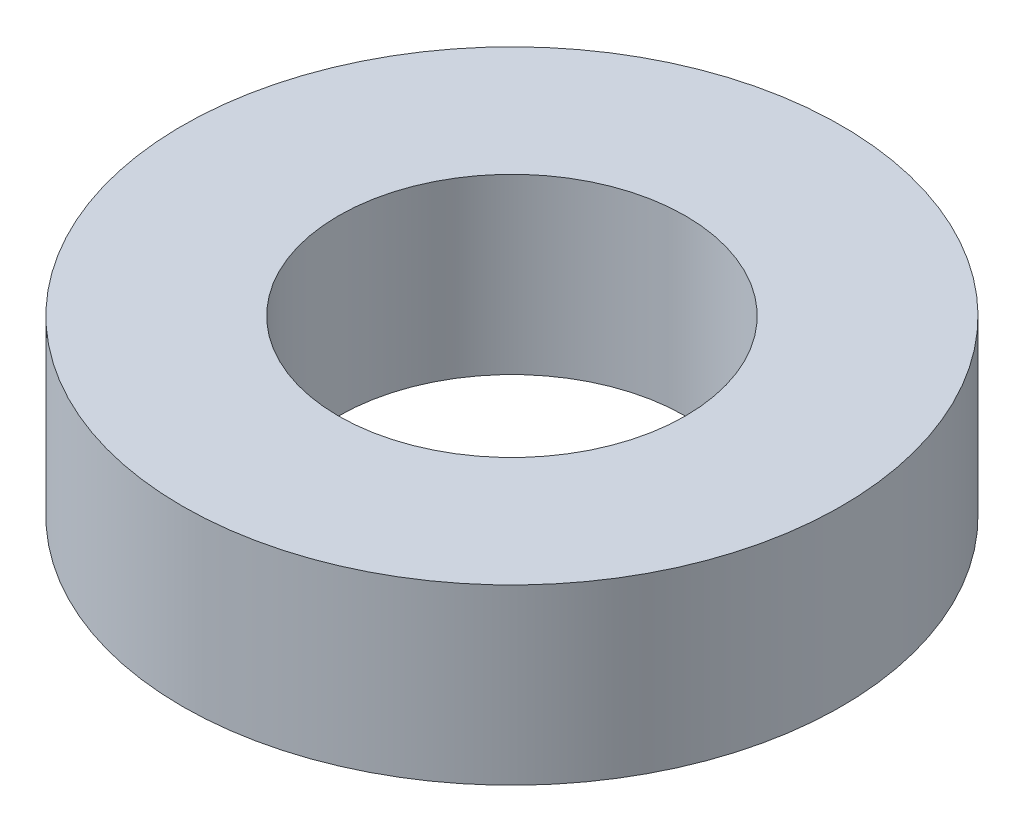
ISO-10303-21;
HEADER;
FILE_DESCRIPTION(('STEP AP214'),'2;1');
FILE_NAME('part.step','',(''),(''),'','','');
FILE_SCHEMA(('AUTOMOTIVE_DESIGN { 1 0 10303 214 1 1 1 1 }'));
ENDSEC;
DATA;
#1=APPLICATION_CONTEXT('core data for automotive mechanical design processes');
#2=APPLICATION_PROTOCOL_DEFINITION('international standard','automotive_design',2000,#1);
#3=PRODUCT_CONTEXT('',#1,'mechanical');
#4=PRODUCT('Part','Part','',(#3));
#5=PRODUCT_RELATED_PRODUCT_CATEGORY('part','',(#4));
#6=PRODUCT_DEFINITION_FORMATION('','',#4);
#7=PRODUCT_DEFINITION_CONTEXT('part definition',#1,'design');
#8=PRODUCT_DEFINITION('design','',#6,#7);
#9=PRODUCT_DEFINITION_SHAPE('','',#8);
#10=(LENGTH_UNIT() NAMED_UNIT(*) SI_UNIT(.MILLI.,.METRE.));
#11=(NAMED_UNIT(*) PLANE_ANGLE_UNIT() SI_UNIT($,.RADIAN.));
#12=(NAMED_UNIT(*) SI_UNIT($,.STERADIAN.) SOLID_ANGLE_UNIT());
#13=UNCERTAINTY_MEASURE_WITH_UNIT(LENGTH_MEASURE(1.E-05),#10,'distance_accuracy_value','');
#14=(GEOMETRIC_REPRESENTATION_CONTEXT(3) GLOBAL_UNCERTAINTY_ASSIGNED_CONTEXT((#13)) GLOBAL_UNIT_ASSIGNED_CONTEXT((#10,
#11,#12)) REPRESENTATION_CONTEXT('',''));
#15=CARTESIAN_POINT('',(0.,0.,0.));
#16=DIRECTION('',(0.,0.,1.));
#17=DIRECTION('',(1.,0.,0.));
#18=AXIS2_PLACEMENT_3D('',#15,#16,#17);
#19=CARTESIAN_POINT('',(0.,5.,0.));
#20=DIRECTION('',(0.,1.,0.));
#21=DIRECTION('',(0.,0.,1.));
#22=AXIS2_PLACEMENT_3D('',#19,#20,#21);
#23=PLANE('',#22);
#24=CARTESIAN_POINT('',(0.,5.,0.));
#25=DIRECTION('',(0.,1.,0.));
#26=DIRECTION('',(0.,0.,1.));
#27=AXIS2_PLACEMENT_3D('',#24,#25,#26);
#28=CIRCLE('',#27,9.5);
#29=CARTESIAN_POINT('',(0.,5.,9.5));
#30=VERTEX_POINT('',#29);
#31=EDGE_CURVE('E10',#30,#30,#28,.T.);
#32=ORIENTED_EDGE('',*,*,#31,.T.);
#33=EDGE_LOOP('',(#32));
#34=FACE_BOUND('',#33,.T.);
#35=CARTESIAN_POINT('',(0.,5.,0.));
#36=DIRECTION('',(0.,1.,0.));
#37=DIRECTION('',(0.,0.,1.));
#38=AXIS2_PLACEMENT_3D('',#35,#36,#37);
#39=CIRCLE('',#38,5.);
#40=CARTESIAN_POINT('',(0.,5.,5.));
#41=VERTEX_POINT('',#40);
#42=EDGE_CURVE('E47',#41,#41,#39,.T.);
#43=ORIENTED_EDGE('',*,*,#42,.F.);
#44=EDGE_LOOP('',(#43));
#45=FACE_BOUND('',#44,.T.);
#46=ADVANCED_FACE('F36',(#34,#45),#23,.T.);
#47=CARTESIAN_POINT('',(0.,0.,0.));
#48=DIRECTION('',(0.,1.,0.));
#49=DIRECTION('',(0.,0.,1.));
#50=AXIS2_PLACEMENT_3D('',#47,#48,#49);
#51=PLANE('',#50);
#52=CARTESIAN_POINT('',(0.,0.,0.));
#53=DIRECTION('',(0.,1.,0.));
#54=DIRECTION('',(0.,0.,1.));
#55=AXIS2_PLACEMENT_3D('',#52,#53,#54);
#56=CIRCLE('',#55,9.5);
#57=CARTESIAN_POINT('',(0.,0.,9.5));
#58=VERTEX_POINT('',#57);
#59=EDGE_CURVE('E40',#58,#58,#56,.T.);
#60=ORIENTED_EDGE('',*,*,#59,.F.);
#61=EDGE_LOOP('',(#60));
#62=FACE_BOUND('',#61,.T.);
#63=CARTESIAN_POINT('',(0.,0.,0.));
#64=DIRECTION('',(0.,1.,0.));
#65=DIRECTION('',(0.,0.,1.));
#66=AXIS2_PLACEMENT_3D('',#63,#64,#65);
#67=CIRCLE('',#66,5.);
#68=CARTESIAN_POINT('',(0.,0.,5.));
#69=VERTEX_POINT('',#68);
#70=EDGE_CURVE('E49',#69,#69,#67,.T.);
#71=ORIENTED_EDGE('',*,*,#70,.T.);
#72=EDGE_LOOP('',(#71));
#73=FACE_BOUND('',#72,.T.);
#74=ADVANCED_FACE('F59',(#62,#73),#51,.F.);
#75=CARTESIAN_POINT('',(0.,5.,0.));
#76=DIRECTION('',(0.,-1.,0.));
#77=DIRECTION('',(0.,0.,-1.));
#78=AXIS2_PLACEMENT_3D('',#75,#76,#77);
#79=CYLINDRICAL_SURFACE('',#78,9.5);
#80=ORIENTED_EDGE('',*,*,#31,.F.);
#81=EDGE_LOOP('',(#80));
#82=FACE_BOUND('',#81,.T.);
#83=ORIENTED_EDGE('',*,*,#59,.T.);
#84=EDGE_LOOP('',(#83));
#85=FACE_BOUND('',#84,.T.);
#86=ADVANCED_FACE('F38',(#82,#85),#79,.T.);
#87=CARTESIAN_POINT('',(0.,5.,0.));
#88=DIRECTION('',(0.,-1.,0.));
#89=DIRECTION('',(0.,0.,-1.));
#90=AXIS2_PLACEMENT_3D('',#87,#88,#89);
#91=CYLINDRICAL_SURFACE('',#90,5.);
#92=ORIENTED_EDGE('',*,*,#42,.T.);
#93=EDGE_LOOP('',(#92));
#94=FACE_BOUND('',#93,.T.);
#95=ORIENTED_EDGE('',*,*,#70,.F.);
#96=EDGE_LOOP('',(#95));
#97=FACE_BOUND('',#96,.T.);
#98=ADVANCED_FACE('F55',(#94,#97),#91,.F.);
#99=CLOSED_SHELL('',(#46,#74,#86,#98));
#100=MANIFOLD_SOLID_BREP('B2',#99);
#101=ADVANCED_BREP_SHAPE_REPRESENTATION('',(#18,#100),#14);
#102=SHAPE_DEFINITION_REPRESENTATION(#9,#101);
ENDSEC;
END-ISO-10303-21;
